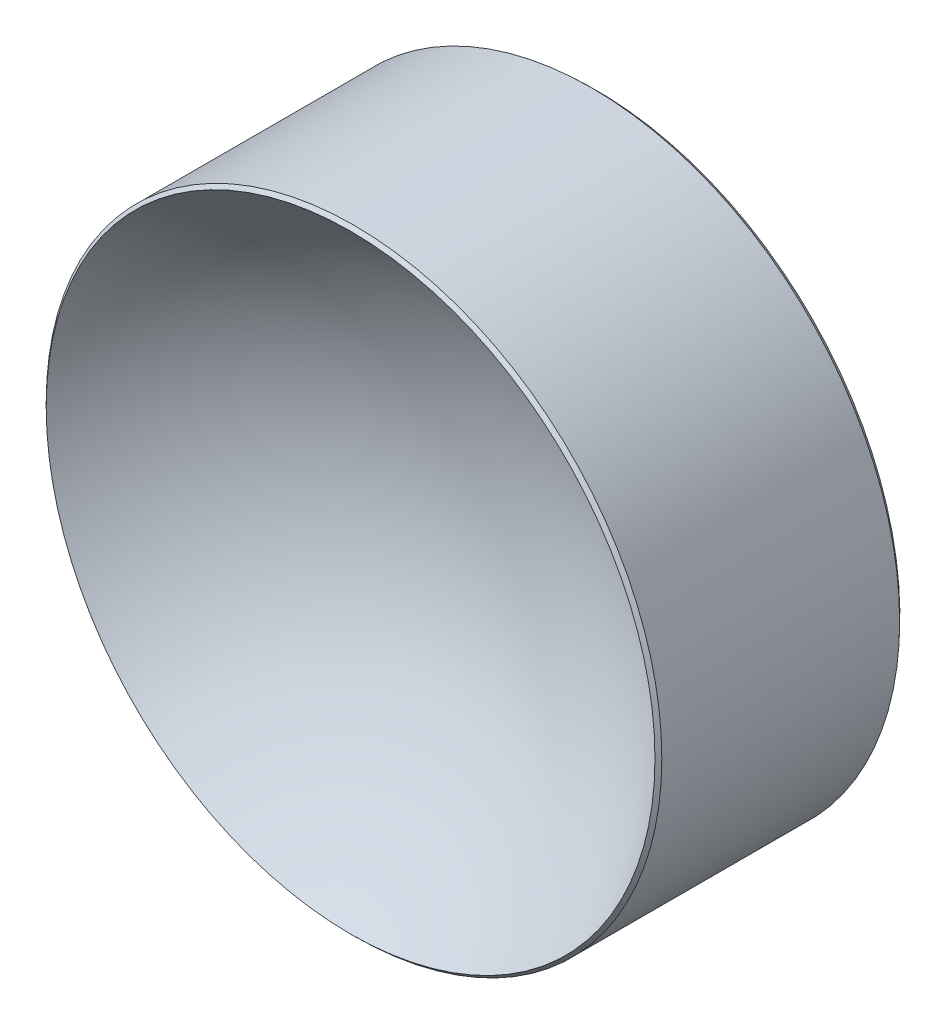
ISO-10303-21;
HEADER;
FILE_DESCRIPTION(('STEP AP214'),'2;1');
FILE_NAME('part.step','',(''),(''),'','','');
FILE_SCHEMA(('AUTOMOTIVE_DESIGN { 1 0 10303 214 1 1 1 1 }'));
ENDSEC;
DATA;
#1=APPLICATION_CONTEXT('core data for automotive mechanical design processes');
#2=APPLICATION_PROTOCOL_DEFINITION('international standard','automotive_design',2000,#1);
#3=PRODUCT_CONTEXT('',#1,'mechanical');
#4=PRODUCT('Part','Part','',(#3));
#5=PRODUCT_RELATED_PRODUCT_CATEGORY('part','',(#4));
#6=PRODUCT_DEFINITION_FORMATION('','',#4);
#7=PRODUCT_DEFINITION_CONTEXT('part definition',#1,'design');
#8=PRODUCT_DEFINITION('design','',#6,#7);
#9=PRODUCT_DEFINITION_SHAPE('','',#8);
#10=(LENGTH_UNIT() NAMED_UNIT(*) SI_UNIT(.MILLI.,.METRE.));
#11=(NAMED_UNIT(*) PLANE_ANGLE_UNIT() SI_UNIT($,.RADIAN.));
#12=(NAMED_UNIT(*) SI_UNIT($,.STERADIAN.) SOLID_ANGLE_UNIT());
#13=UNCERTAINTY_MEASURE_WITH_UNIT(LENGTH_MEASURE(1.E-05),#10,'distance_accuracy_value','');
#14=(GEOMETRIC_REPRESENTATION_CONTEXT(3) GLOBAL_UNCERTAINTY_ASSIGNED_CONTEXT((#13)) GLOBAL_UNIT_ASSIGNED_CONTEXT((#10,
#11,#12)) REPRESENTATION_CONTEXT('',''));
#15=CARTESIAN_POINT('',(0.,0.,0.));
#16=DIRECTION('',(0.,0.,1.));
#17=DIRECTION('',(1.,0.,0.));
#18=AXIS2_PLACEMENT_3D('',#15,#16,#17);
#19=CARTESIAN_POINT('',(0.,0.,14.1929719783046));
#20=DIRECTION('',(0.,0.,1.));
#21=DIRECTION('',(0.,1.,0.));
#22=AXIS2_PLACEMENT_3D('',#19,#20,#21);
#23=SPHERICAL_SURFACE('',#22,15.5);
#24=CARTESIAN_POINT('',(0.,0.,5.10825390626587));
#25=DIRECTION('',(0.,0.,1.));
#26=DIRECTION('',(0.,-1.,0.));
#27=AXIS2_PLACEMENT_3D('',#24,#25,#26);
#28=CIRCLE('',#27,12.5585786437627);
#29=CARTESIAN_POINT('',(0.,-12.5585786437627,5.10825390626586));
#30=VERTEX_POINT('',#29);
#31=EDGE_CURVE('E28',#30,#30,#28,.T.);
#32=ORIENTED_EDGE('',*,*,#31,.T.);
#33=EDGE_LOOP('',(#32));
#34=FACE_BOUND('',#33,.T.);
#35=ADVANCED_FACE('F13',(#34),#23,.F.);
#36=CARTESIAN_POINT('',(0.,0.,302.985971978305));
#37=DIRECTION('',(0.,0.,1.));
#38=DIRECTION('',(0.,-1.,0.));
#39=AXIS2_PLACEMENT_3D('',#36,#37,#38);
#40=SPHERICAL_SURFACE('',#39,308.293);
#41=CARTESIAN_POINT('',(0.,0.,-5.05350273868996));
#42=DIRECTION('',(0.,0.,1.));
#43=DIRECTION('',(0.,-1.,0.));
#44=AXIS2_PLACEMENT_3D('',#41,#42,#43);
#45=CIRCLE('',#44,12.500234600919);
#46=CARTESIAN_POINT('',(0.,-12.5002346009189,-5.05350273868996));
#47=VERTEX_POINT('',#46);
#48=EDGE_CURVE('E9',#47,#47,#45,.F.);
#49=ORIENTED_EDGE('',*,*,#48,.T.);
#50=EDGE_LOOP('',(#49));
#51=FACE_BOUND('',#50,.T.);
#52=ADVANCED_FACE('F43',(#51),#40,.T.);
#53=CARTESIAN_POINT('',(0.,0.,-1.30702802169538));
#54=DIRECTION('',(0.,0.,1.));
#55=DIRECTION('',(0.,-1.,0.));
#56=AXIS2_PLACEMENT_3D('',#53,#54,#55);
#57=CYLINDRICAL_SURFACE('',#56,12.7);
#58=CARTESIAN_POINT('',(0.,0.,-4.84533138062357));
#59=DIRECTION('',(0.,0.,1.));
#60=DIRECTION('',(0.,-1.,0.));
#61=AXIS2_PLACEMENT_3D('',#58,#59,#60);
#62=CIRCLE('',#61,12.7);
#63=CARTESIAN_POINT('',(0.,-12.7,-4.84533138062357));
#64=VERTEX_POINT('',#63);
#65=EDGE_CURVE('E20',#64,#64,#62,.T.);
#66=ORIENTED_EDGE('',*,*,#65,.T.);
#67=EDGE_LOOP('',(#66));
#68=FACE_BOUND('',#67,.T.);
#69=CARTESIAN_POINT('',(0.,0.,4.96683255002856));
#70=DIRECTION('',(0.,0.,1.));
#71=DIRECTION('',(0.,-1.,0.));
#72=AXIS2_PLACEMENT_3D('',#69,#70,#71);
#73=CIRCLE('',#72,12.7);
#74=CARTESIAN_POINT('',(0.,-12.7,4.96683255002855));
#75=VERTEX_POINT('',#74);
#76=EDGE_CURVE('E24',#75,#75,#73,.T.);
#77=ORIENTED_EDGE('',*,*,#76,.F.);
#78=EDGE_LOOP('',(#77));
#79=FACE_BOUND('',#78,.T.);
#80=ADVANCED_FACE('F38',(#68,#79),#57,.T.);
#81=CARTESIAN_POINT('',(0.,0.,4.96683255002856));
#82=DIRECTION('',(0.,0.,-1.));
#83=DIRECTION('',(0.,1.,0.));
#84=AXIS2_PLACEMENT_3D('',#81,#82,#83);
#85=CONICAL_SURFACE('',#84,12.7,0.785398163397448);
#86=ORIENTED_EDGE('',*,*,#31,.F.);
#87=EDGE_LOOP('',(#86));
#88=FACE_BOUND('',#87,.T.);
#89=ORIENTED_EDGE('',*,*,#76,.T.);
#90=EDGE_LOOP('',(#89));
#91=FACE_BOUND('',#90,.T.);
#92=ADVANCED_FACE('F35',(#88,#91),#85,.T.);
#93=CARTESIAN_POINT('',(0.,0.,-4.84533138062357));
#94=DIRECTION('',(0.,0.,1.));
#95=DIRECTION('',(0.,-1.,0.));
#96=AXIS2_PLACEMENT_3D('',#93,#94,#95);
#97=CONICAL_SURFACE('',#96,12.7,0.764795044425033);
#98=ORIENTED_EDGE('',*,*,#48,.F.);
#99=EDGE_LOOP('',(#98));
#100=FACE_BOUND('',#99,.T.);
#101=ORIENTED_EDGE('',*,*,#65,.F.);
#102=EDGE_LOOP('',(#101));
#103=FACE_BOUND('',#102,.T.);
#104=ADVANCED_FACE('F15',(#100,#103),#97,.T.);
#105=CLOSED_SHELL('',(#35,#52,#80,#92,#104));
#106=MANIFOLD_SOLID_BREP('B1',#105);
#107=ADVANCED_BREP_SHAPE_REPRESENTATION('',(#18,#106),#14);
#108=SHAPE_DEFINITION_REPRESENTATION(#9,#107);
ENDSEC;
END-ISO-10303-21;
